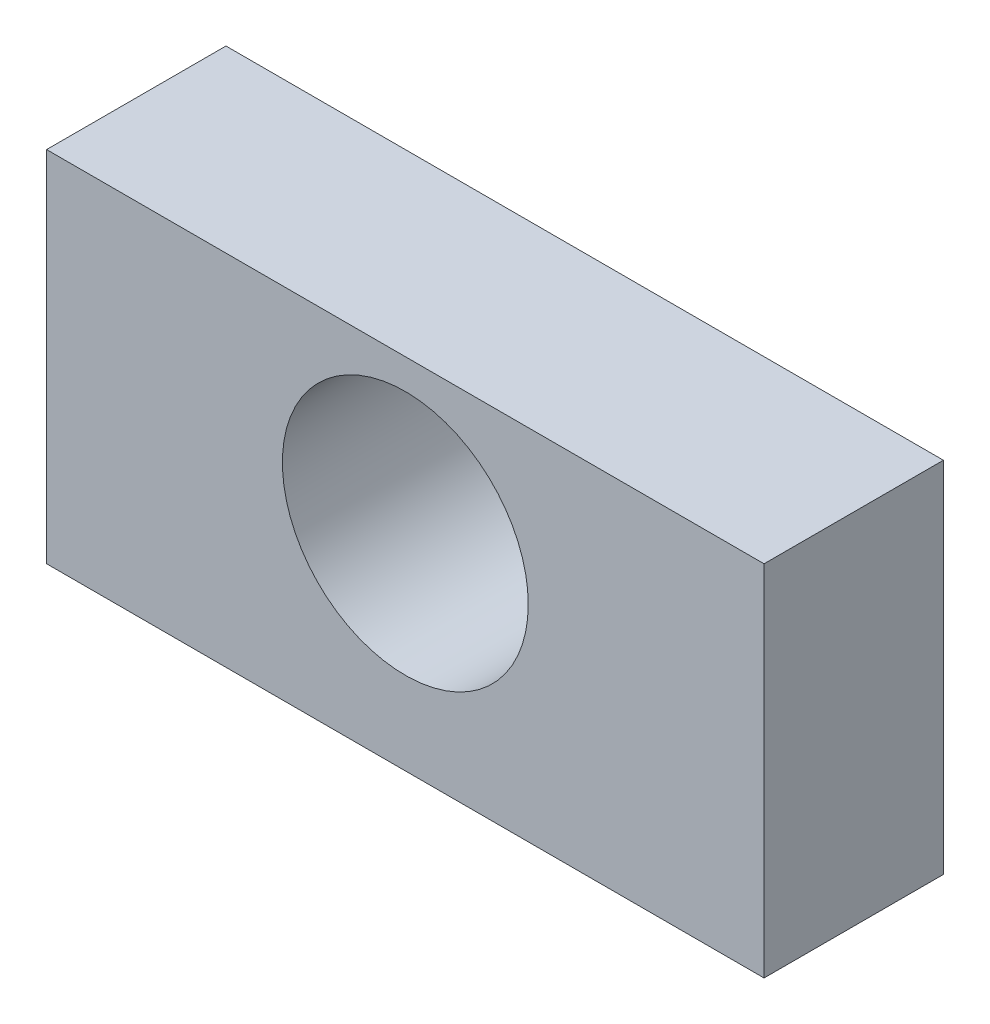
ISO-10303-21;
HEADER;
FILE_DESCRIPTION(('STEP AP214'),'2;1');
FILE_NAME('part.step','',(''),(''),'','','');
FILE_SCHEMA(('AUTOMOTIVE_DESIGN { 1 0 10303 214 1 1 1 1 }'));
ENDSEC;
DATA;
#1=APPLICATION_CONTEXT('core data for automotive mechanical design processes');
#2=APPLICATION_PROTOCOL_DEFINITION('international standard','automotive_design',2000,#1);
#3=PRODUCT_CONTEXT('',#1,'mechanical');
#4=PRODUCT('Part','Part','',(#3));
#5=PRODUCT_RELATED_PRODUCT_CATEGORY('part','',(#4));
#6=PRODUCT_DEFINITION_FORMATION('','',#4);
#7=PRODUCT_DEFINITION_CONTEXT('part definition',#1,'design');
#8=PRODUCT_DEFINITION('design','',#6,#7);
#9=PRODUCT_DEFINITION_SHAPE('','',#8);
#10=(LENGTH_UNIT() NAMED_UNIT(*) SI_UNIT(.MILLI.,.METRE.));
#11=(NAMED_UNIT(*) PLANE_ANGLE_UNIT() SI_UNIT($,.RADIAN.));
#12=(NAMED_UNIT(*) SI_UNIT($,.STERADIAN.) SOLID_ANGLE_UNIT());
#13=UNCERTAINTY_MEASURE_WITH_UNIT(LENGTH_MEASURE(1.E-05),#10,'distance_accuracy_value','');
#14=(GEOMETRIC_REPRESENTATION_CONTEXT(3) GLOBAL_UNCERTAINTY_ASSIGNED_CONTEXT((#13)) GLOBAL_UNIT_ASSIGNED_CONTEXT((#10,
#11,#12)) REPRESENTATION_CONTEXT('',''));
#15=CARTESIAN_POINT('',(0.,0.,0.));
#16=DIRECTION('',(0.,0.,1.));
#17=DIRECTION('',(1.,0.,0.));
#18=AXIS2_PLACEMENT_3D('',#15,#16,#17);
#19=CARTESIAN_POINT('',(9.525,-4.7625,4.7625));
#20=DIRECTION('',(-1.,0.,0.));
#21=DIRECTION('',(0.,0.,1.));
#22=AXIS2_PLACEMENT_3D('',#19,#20,#21);
#23=PLANE('',#22);
#24=DIRECTION('',(0.,1.,0.));
#25=VECTOR('',#24,1.);
#26=CARTESIAN_POINT('',(9.525,-4.7625,0.));
#27=LINE('',#26,#25);
#28=CARTESIAN_POINT('',(9.525,-4.7625,0.));
#29=VERTEX_POINT('',#28);
#30=CARTESIAN_POINT('',(9.525,4.7625,0.));
#31=VERTEX_POINT('',#30);
#32=EDGE_CURVE('E97',#29,#31,#27,.T.);
#33=ORIENTED_EDGE('',*,*,#32,.T.);
#34=DIRECTION('',(0.,0.,-1.));
#35=VECTOR('',#34,1.);
#36=CARTESIAN_POINT('',(9.525,4.7625,4.7625));
#37=LINE('',#36,#35);
#38=CARTESIAN_POINT('',(9.525,4.7625,4.7625));
#39=VERTEX_POINT('',#38);
#40=EDGE_CURVE('E11',#39,#31,#37,.T.);
#41=ORIENTED_EDGE('',*,*,#40,.F.);
#42=DIRECTION('',(0.,1.,0.));
#43=VECTOR('',#42,1.);
#44=CARTESIAN_POINT('',(9.525,-4.7625,4.7625));
#45=LINE('',#44,#43);
#46=CARTESIAN_POINT('',(9.525,-4.7625,4.7625));
#47=VERTEX_POINT('',#46);
#48=EDGE_CURVE('E85',#47,#39,#45,.T.);
#49=ORIENTED_EDGE('',*,*,#48,.F.);
#50=DIRECTION('',(0.,0.,-1.));
#51=VECTOR('',#50,1.);
#52=CARTESIAN_POINT('',(9.525,-4.7625,4.7625));
#53=LINE('',#52,#51);
#54=EDGE_CURVE('E93',#47,#29,#53,.T.);
#55=ORIENTED_EDGE('',*,*,#54,.T.);
#56=EDGE_LOOP('',(#33,#41,#49,#55));
#57=FACE_BOUND('',#56,.T.);
#58=ADVANCED_FACE('F34',(#57),#23,.F.);
#59=CARTESIAN_POINT('',(-9.525,4.7625,4.7625));
#60=DIRECTION('',(0.,-1.,0.));
#61=DIRECTION('',(0.,0.,-1.));
#62=AXIS2_PLACEMENT_3D('',#59,#60,#61);
#63=PLANE('',#62);
#64=DIRECTION('',(-1.,0.,0.));
#65=VECTOR('',#64,1.);
#66=CARTESIAN_POINT('',(-9.525,4.7625,0.));
#67=LINE('',#66,#65);
#68=CARTESIAN_POINT('',(-9.525,4.7625,0.));
#69=VERTEX_POINT('',#68);
#70=EDGE_CURVE('E89',#31,#69,#67,.T.);
#71=ORIENTED_EDGE('',*,*,#70,.T.);
#72=DIRECTION('',(0.,0.,-1.));
#73=VECTOR('',#72,1.);
#74=CARTESIAN_POINT('',(-9.525,4.7625,4.7625));
#75=LINE('',#74,#73);
#76=CARTESIAN_POINT('',(-9.525,4.7625,4.7625));
#77=VERTEX_POINT('',#76);
#78=EDGE_CURVE('E42',#77,#69,#75,.T.);
#79=ORIENTED_EDGE('',*,*,#78,.F.);
#80=DIRECTION('',(-1.,0.,0.));
#81=VECTOR('',#80,1.);
#82=CARTESIAN_POINT('',(-9.525,4.7625,4.7625));
#83=LINE('',#82,#81);
#84=EDGE_CURVE('E80',#39,#77,#83,.T.);
#85=ORIENTED_EDGE('',*,*,#84,.F.);
#86=ORIENTED_EDGE('',*,*,#40,.T.);
#87=EDGE_LOOP('',(#71,#79,#85,#86));
#88=FACE_BOUND('',#87,.T.);
#89=ADVANCED_FACE('F88',(#88),#63,.F.);
#90=CARTESIAN_POINT('',(-9.525,-4.7625,4.7625));
#91=DIRECTION('',(1.,0.,0.));
#92=DIRECTION('',(0.,0.,-1.));
#93=AXIS2_PLACEMENT_3D('',#90,#91,#92);
#94=PLANE('',#93);
#95=DIRECTION('',(0.,-1.,0.));
#96=VECTOR('',#95,1.);
#97=CARTESIAN_POINT('',(-9.525,-4.7625,0.));
#98=LINE('',#97,#96);
#99=CARTESIAN_POINT('',(-9.525,-4.7625,0.));
#100=VERTEX_POINT('',#99);
#101=EDGE_CURVE('E67',#69,#100,#98,.T.);
#102=ORIENTED_EDGE('',*,*,#101,.T.);
#103=DIRECTION('',(0.,0.,-1.));
#104=VECTOR('',#103,1.);
#105=CARTESIAN_POINT('',(-9.525,-4.7625,4.7625));
#106=LINE('',#105,#104);
#107=CARTESIAN_POINT('',(-9.525,-4.7625,4.7625));
#108=VERTEX_POINT('',#107);
#109=EDGE_CURVE('E90',#108,#100,#106,.T.);
#110=ORIENTED_EDGE('',*,*,#109,.F.);
#111=DIRECTION('',(0.,-1.,0.));
#112=VECTOR('',#111,1.);
#113=CARTESIAN_POINT('',(-9.525,-4.7625,4.7625));
#114=LINE('',#113,#112);
#115=EDGE_CURVE('E83',#77,#108,#114,.T.);
#116=ORIENTED_EDGE('',*,*,#115,.F.);
#117=ORIENTED_EDGE('',*,*,#78,.T.);
#118=EDGE_LOOP('',(#102,#110,#116,#117));
#119=FACE_BOUND('',#118,.T.);
#120=ADVANCED_FACE('F91',(#119),#94,.F.);
#121=CARTESIAN_POINT('',(-9.525,-4.7625,4.7625));
#122=DIRECTION('',(0.,1.,0.));
#123=DIRECTION('',(0.,0.,1.));
#124=AXIS2_PLACEMENT_3D('',#121,#122,#123);
#125=PLANE('',#124);
#126=DIRECTION('',(1.,0.,0.));
#127=VECTOR('',#126,1.);
#128=CARTESIAN_POINT('',(-9.525,-4.7625,0.));
#129=LINE('',#128,#127);
#130=EDGE_CURVE('E73',#100,#29,#129,.T.);
#131=ORIENTED_EDGE('',*,*,#130,.T.);
#132=ORIENTED_EDGE('',*,*,#54,.F.);
#133=DIRECTION('',(1.,0.,0.));
#134=VECTOR('',#133,1.);
#135=CARTESIAN_POINT('',(-9.525,-4.7625,4.7625));
#136=LINE('',#135,#134);
#137=EDGE_CURVE('E50',#108,#47,#136,.T.);
#138=ORIENTED_EDGE('',*,*,#137,.F.);
#139=ORIENTED_EDGE('',*,*,#109,.T.);
#140=EDGE_LOOP('',(#131,#132,#138,#139));
#141=FACE_BOUND('',#140,.T.);
#142=ADVANCED_FACE('F105',(#141),#125,.F.);
#143=CARTESIAN_POINT('',(9.525,4.7625,4.7625));
#144=DIRECTION('',(0.,0.,-1.));
#145=DIRECTION('',(-1.,0.,0.));
#146=AXIS2_PLACEMENT_3D('',#143,#144,#145);
#147=PLANE('',#146);
#148=CARTESIAN_POINT('',(0.,0.698499999999991,4.7625));
#149=DIRECTION('',(0.,0.,1.));
#150=DIRECTION('',(1.,0.,0.));
#151=AXIS2_PLACEMENT_3D('',#148,#149,#150);
#152=CIRCLE('',#151,3.2639);
#153=CARTESIAN_POINT('',(3.2639,0.698499999999991,4.7625));
#154=VERTEX_POINT('',#153);
#155=EDGE_CURVE('E113',#154,#154,#152,.T.);
#156=ORIENTED_EDGE('',*,*,#155,.F.);
#157=EDGE_LOOP('',(#156));
#158=FACE_BOUND('',#157,.T.);
#159=ORIENTED_EDGE('',*,*,#48,.T.);
#160=ORIENTED_EDGE('',*,*,#84,.T.);
#161=ORIENTED_EDGE('',*,*,#115,.T.);
#162=ORIENTED_EDGE('',*,*,#137,.T.);
#163=EDGE_LOOP('',(#159,#160,#161,#162));
#164=FACE_BOUND('',#163,.T.);
#165=ADVANCED_FACE('F81',(#158,#164),#147,.F.);
#166=CARTESIAN_POINT('',(9.525,4.7625,0.));
#167=DIRECTION('',(0.,0.,-1.));
#168=DIRECTION('',(-1.,0.,0.));
#169=AXIS2_PLACEMENT_3D('',#166,#167,#168);
#170=PLANE('',#169);
#171=CARTESIAN_POINT('',(0.,0.698499999999991,0.));
#172=DIRECTION('',(0.,0.,-1.));
#173=DIRECTION('',(-1.,0.,0.));
#174=AXIS2_PLACEMENT_3D('',#171,#172,#173);
#175=CIRCLE('',#174,3.2639);
#176=CARTESIAN_POINT('',(-3.2639,0.698499999999991,0.));
#177=VERTEX_POINT('',#176);
#178=EDGE_CURVE('E100',#177,#177,#175,.T.);
#179=ORIENTED_EDGE('',*,*,#178,.F.);
#180=EDGE_LOOP('',(#179));
#181=FACE_BOUND('',#180,.T.);
#182=ORIENTED_EDGE('',*,*,#32,.F.);
#183=ORIENTED_EDGE('',*,*,#130,.F.);
#184=ORIENTED_EDGE('',*,*,#101,.F.);
#185=ORIENTED_EDGE('',*,*,#70,.F.);
#186=EDGE_LOOP('',(#182,#183,#184,#185));
#187=FACE_BOUND('',#186,.T.);
#188=ADVANCED_FACE('F108',(#181,#187),#170,.T.);
#189=CARTESIAN_POINT('',(0.,0.698499999999991,4.7625));
#190=DIRECTION('',(0.,0.,1.));
#191=DIRECTION('',(1.,0.,0.));
#192=AXIS2_PLACEMENT_3D('',#189,#190,#191);
#193=CYLINDRICAL_SURFACE('',#192,3.2639);
#194=ORIENTED_EDGE('',*,*,#178,.T.);
#195=EDGE_LOOP('',(#194));
#196=FACE_BOUND('',#195,.T.);
#197=ORIENTED_EDGE('',*,*,#155,.T.);
#198=EDGE_LOOP('',(#197));
#199=FACE_BOUND('',#198,.T.);
#200=ADVANCED_FACE('F117',(#196,#199),#193,.F.);
#201=CLOSED_SHELL('',(#58,#89,#120,#142,#165,#188,#200));
#202=MANIFOLD_SOLID_BREP('B2',#201);
#203=ADVANCED_BREP_SHAPE_REPRESENTATION('',(#18,#202),#14);
#204=SHAPE_DEFINITION_REPRESENTATION(#9,#203);
ENDSEC;
END-ISO-10303-21;
